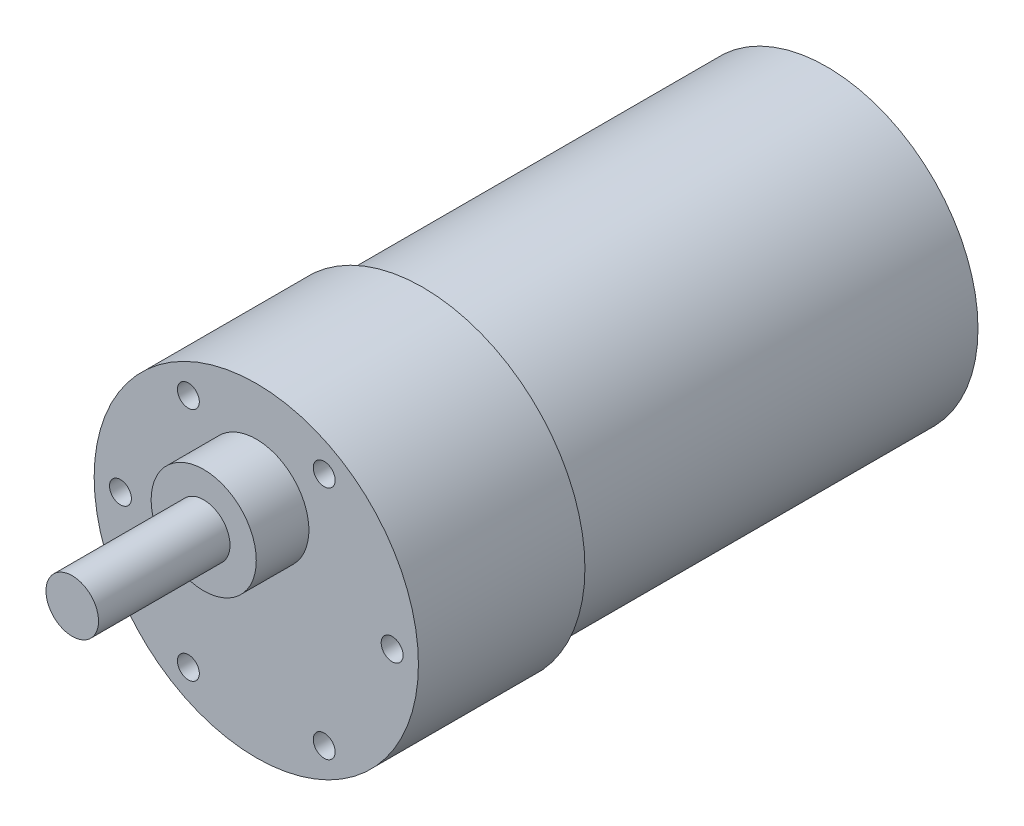
ISO-10303-21;
HEADER;
FILE_DESCRIPTION(('STEP AP214'),'2;1');
FILE_NAME('part.step','',(''),(''),'','','');
FILE_SCHEMA(('AUTOMOTIVE_DESIGN { 1 0 10303 214 1 1 1 1 }'));
ENDSEC;
DATA;
#1=APPLICATION_CONTEXT('core data for automotive mechanical design processes');
#2=APPLICATION_PROTOCOL_DEFINITION('international standard','automotive_design',2000,#1);
#3=PRODUCT_CONTEXT('',#1,'mechanical');
#4=PRODUCT('Part','Part','',(#3));
#5=PRODUCT_RELATED_PRODUCT_CATEGORY('part','',(#4));
#6=PRODUCT_DEFINITION_FORMATION('','',#4);
#7=PRODUCT_DEFINITION_CONTEXT('part definition',#1,'design');
#8=PRODUCT_DEFINITION('design','',#6,#7);
#9=PRODUCT_DEFINITION_SHAPE('','',#8);
#10=(LENGTH_UNIT() NAMED_UNIT(*) SI_UNIT(.MILLI.,.METRE.));
#11=(NAMED_UNIT(*) PLANE_ANGLE_UNIT() SI_UNIT($,.RADIAN.));
#12=(NAMED_UNIT(*) SI_UNIT($,.STERADIAN.) SOLID_ANGLE_UNIT());
#13=UNCERTAINTY_MEASURE_WITH_UNIT(LENGTH_MEASURE(1.E-05),#10,'distance_accuracy_value','');
#14=(GEOMETRIC_REPRESENTATION_CONTEXT(3) GLOBAL_UNCERTAINTY_ASSIGNED_CONTEXT((#13)) GLOBAL_UNIT_ASSIGNED_CONTEXT((#10,
#11,#12)) REPRESENTATION_CONTEXT('',''));
#15=CARTESIAN_POINT('',(0.,0.,0.));
#16=DIRECTION('',(0.,0.,1.));
#17=DIRECTION('',(1.,0.,0.));
#18=AXIS2_PLACEMENT_3D('',#15,#16,#17);
#19=CARTESIAN_POINT('',(0.,0.,0.));
#20=DIRECTION('',(0.,0.,-1.));
#21=DIRECTION('',(-1.,0.,0.));
#22=AXIS2_PLACEMENT_3D('',#19,#20,#21);
#23=PLANE('',#22);
#24=CARTESIAN_POINT('',(-15.5,1.08235921504137E-13,0.));
#25=DIRECTION('',(0.,0.,1.));
#26=DIRECTION('',(1.,0.,0.));
#27=AXIS2_PLACEMENT_3D('',#24,#25,#26);
#28=CIRCLE('',#27,1.25);
#29=CARTESIAN_POINT('',(-14.25,1.08235921504137E-13,0.));
#30=VERTEX_POINT('',#29);
#31=EDGE_CURVE('E72',#30,#30,#28,.T.);
#32=ORIENTED_EDGE('',*,*,#31,.F.);
#33=EDGE_LOOP('',(#32));
#34=FACE_BOUND('',#33,.T.);
#35=CARTESIAN_POINT('',(-7.74999999999987,13.4233937586589,0.));
#36=DIRECTION('',(0.,0.,1.));
#37=DIRECTION('',(1.,0.,0.));
#38=AXIS2_PLACEMENT_3D('',#35,#36,#37);
#39=CIRCLE('',#38,1.25);
#40=CARTESIAN_POINT('',(-6.49999999999988,13.4233937586589,0.));
#41=VERTEX_POINT('',#40);
#42=EDGE_CURVE('E71',#41,#41,#39,.T.);
#43=ORIENTED_EDGE('',*,*,#42,.F.);
#44=EDGE_LOOP('',(#43));
#45=FACE_BOUND('',#44,.T.);
#46=CARTESIAN_POINT('',(7.75000000000016,13.4233937586587,0.));
#47=DIRECTION('',(0.,0.,1.));
#48=DIRECTION('',(1.,0.,0.));
#49=AXIS2_PLACEMENT_3D('',#46,#47,#48);
#50=CIRCLE('',#49,1.25);
#51=CARTESIAN_POINT('',(9.00000000000016,13.4233937586587,0.));
#52=VERTEX_POINT('',#51);
#53=EDGE_CURVE('E82',#52,#52,#50,.T.);
#54=ORIENTED_EDGE('',*,*,#53,.F.);
#55=EDGE_LOOP('',(#54));
#56=FACE_BOUND('',#55,.T.);
#57=CARTESIAN_POINT('',(15.5,0.,0.));
#58=DIRECTION('',(0.,0.,1.));
#59=DIRECTION('',(1.,0.,0.));
#60=AXIS2_PLACEMENT_3D('',#57,#58,#59);
#61=CIRCLE('',#60,1.25);
#62=CARTESIAN_POINT('',(16.75,0.,0.));
#63=VERTEX_POINT('',#62);
#64=EDGE_CURVE('E88',#63,#63,#61,.T.);
#65=ORIENTED_EDGE('',*,*,#64,.F.);
#66=EDGE_LOOP('',(#65));
#67=FACE_BOUND('',#66,.T.);
#68=CARTESIAN_POINT('',(7.74999999999997,-13.4233937586588,0.));
#69=DIRECTION('',(0.,0.,1.));
#70=DIRECTION('',(1.,0.,0.));
#71=AXIS2_PLACEMENT_3D('',#68,#69,#70);
#72=CIRCLE('',#71,1.25);
#73=CARTESIAN_POINT('',(8.99999999999997,-13.4233937586588,0.));
#74=VERTEX_POINT('',#73);
#75=EDGE_CURVE('E94',#74,#74,#72,.T.);
#76=ORIENTED_EDGE('',*,*,#75,.F.);
#77=EDGE_LOOP('',(#76));
#78=FACE_BOUND('',#77,.T.);
#79=CARTESIAN_POINT('',(-7.75000000000006,-13.4233937586588,0.));
#80=DIRECTION('',(0.,0.,1.));
#81=DIRECTION('',(1.,0.,0.));
#82=AXIS2_PLACEMENT_3D('',#79,#80,#81);
#83=CIRCLE('',#82,1.25);
#84=CARTESIAN_POINT('',(-6.50000000000006,-13.4233937586588,0.));
#85=VERTEX_POINT('',#84);
#86=EDGE_CURVE('E100',#85,#85,#83,.T.);
#87=ORIENTED_EDGE('',*,*,#86,.F.);
#88=EDGE_LOOP('',(#87));
#89=FACE_BOUND('',#88,.T.);
#90=CARTESIAN_POINT('',(0.,7.,0.));
#91=DIRECTION('',(0.,0.,-1.));
#92=DIRECTION('',(-1.,0.,0.));
#93=AXIS2_PLACEMENT_3D('',#90,#91,#92);
#94=CIRCLE('',#93,6.);
#95=CARTESIAN_POINT('',(-6.,7.,0.));
#96=VERTEX_POINT('',#95);
#97=EDGE_CURVE('E11',#96,#96,#94,.F.);
#98=ORIENTED_EDGE('',*,*,#97,.F.);
#99=EDGE_LOOP('',(#98));
#100=FACE_BOUND('',#99,.T.);
#101=CARTESIAN_POINT('',(0.,0.,0.));
#102=DIRECTION('',(0.,0.,1.));
#103=DIRECTION('',(1.,0.,0.));
#104=AXIS2_PLACEMENT_3D('',#101,#102,#103);
#105=CIRCLE('',#104,18.5);
#106=CARTESIAN_POINT('',(18.5,0.,0.));
#107=VERTEX_POINT('',#106);
#108=EDGE_CURVE('E42',#107,#107,#105,.T.);
#109=ORIENTED_EDGE('',*,*,#108,.T.);
#110=EDGE_LOOP('',(#109));
#111=FACE_BOUND('',#110,.T.);
#112=ADVANCED_FACE('F34',(#34,#45,#56,#67,#78,#89,#100,#111),#23,.F.);
#113=CARTESIAN_POINT('',(0.,0.,4.91840427773817));
#114=DIRECTION('',(0.,0.,1.));
#115=DIRECTION('',(1.,0.,0.));
#116=AXIS2_PLACEMENT_3D('',#113,#114,#115);
#117=CYLINDRICAL_SURFACE('',#116,18.5);
#118=ORIENTED_EDGE('',*,*,#108,.F.);
#119=EDGE_LOOP('',(#118));
#120=FACE_BOUND('',#119,.T.);
#121=CARTESIAN_POINT('',(0.,0.,-19.));
#122=DIRECTION('',(0.,0.,1.));
#123=DIRECTION('',(1.,0.,0.));
#124=AXIS2_PLACEMENT_3D('',#121,#122,#123);
#125=CIRCLE('',#124,18.5);
#126=CARTESIAN_POINT('',(18.5,0.,-19.));
#127=VERTEX_POINT('',#126);
#128=EDGE_CURVE('E118',#127,#127,#125,.T.);
#129=ORIENTED_EDGE('',*,*,#128,.T.);
#130=EDGE_LOOP('',(#129));
#131=FACE_BOUND('',#130,.T.);
#132=ADVANCED_FACE('F125',(#120,#131),#117,.T.);
#133=CARTESIAN_POINT('',(0.,18.5,-19.));
#134=DIRECTION('',(0.,0.,1.));
#135=DIRECTION('',(1.,0.,0.));
#136=AXIS2_PLACEMENT_3D('',#133,#134,#135);
#137=PLANE('',#136);
#138=ORIENTED_EDGE('',*,*,#128,.F.);
#139=EDGE_LOOP('',(#138));
#140=FACE_BOUND('',#139,.T.);
#141=CARTESIAN_POINT('',(0.,0.,-19.));
#142=DIRECTION('',(0.,0.,1.));
#143=DIRECTION('',(1.,0.,0.));
#144=AXIS2_PLACEMENT_3D('',#141,#142,#143);
#145=CIRCLE('',#144,17.25);
#146=CARTESIAN_POINT('',(17.25,0.,-19.));
#147=VERTEX_POINT('',#146);
#148=EDGE_CURVE('E115',#147,#147,#145,.T.);
#149=ORIENTED_EDGE('',*,*,#148,.T.);
#150=EDGE_LOOP('',(#149));
#151=FACE_BOUND('',#150,.T.);
#152=ADVANCED_FACE('F128',(#140,#151),#137,.F.);
#153=CARTESIAN_POINT('',(0.,0.,4.91840427773817));
#154=DIRECTION('',(0.,0.,1.));
#155=DIRECTION('',(1.,0.,0.));
#156=AXIS2_PLACEMENT_3D('',#153,#154,#155);
#157=CYLINDRICAL_SURFACE('',#156,17.25);
#158=ORIENTED_EDGE('',*,*,#148,.F.);
#159=EDGE_LOOP('',(#158));
#160=FACE_BOUND('',#159,.T.);
#161=CARTESIAN_POINT('',(0.,0.,-65.1));
#162=DIRECTION('',(0.,0.,1.));
#163=DIRECTION('',(1.,0.,0.));
#164=AXIS2_PLACEMENT_3D('',#161,#162,#163);
#165=CIRCLE('',#164,17.25);
#166=CARTESIAN_POINT('',(17.25,0.,-65.1));
#167=VERTEX_POINT('',#166);
#168=EDGE_CURVE('E112',#167,#167,#165,.T.);
#169=ORIENTED_EDGE('',*,*,#168,.T.);
#170=EDGE_LOOP('',(#169));
#171=FACE_BOUND('',#170,.T.);
#172=ADVANCED_FACE('F133',(#160,#171),#157,.T.);
#173=CARTESIAN_POINT('',(0.,17.25,-65.1));
#174=DIRECTION('',(0.,0.,1.));
#175=DIRECTION('',(1.,0.,0.));
#176=AXIS2_PLACEMENT_3D('',#173,#174,#175);
#177=PLANE('',#176);
#178=ORIENTED_EDGE('',*,*,#168,.F.);
#179=EDGE_LOOP('',(#178));
#180=FACE_BOUND('',#179,.T.);
#181=ADVANCED_FACE('F139',(#180),#177,.F.);
#182=CARTESIAN_POINT('',(0.,7.,6.));
#183=DIRECTION('',(0.,0.,-1.));
#184=DIRECTION('',(-1.,0.,0.));
#185=AXIS2_PLACEMENT_3D('',#182,#183,#184);
#186=CYLINDRICAL_SURFACE('',#185,6.);
#187=CARTESIAN_POINT('',(0.,7.,6.));
#188=DIRECTION('',(0.,0.,1.));
#189=DIRECTION('',(1.,0.,0.));
#190=AXIS2_PLACEMENT_3D('',#187,#188,#189);
#191=CIRCLE('',#190,6.);
#192=CARTESIAN_POINT('',(6.,7.,6.));
#193=VERTEX_POINT('',#192);
#194=EDGE_CURVE('E109',#193,#193,#191,.T.);
#195=ORIENTED_EDGE('',*,*,#194,.F.);
#196=EDGE_LOOP('',(#195));
#197=FACE_BOUND('',#196,.T.);
#198=ORIENTED_EDGE('',*,*,#97,.T.);
#199=EDGE_LOOP('',(#198));
#200=FACE_BOUND('',#199,.T.);
#201=ADVANCED_FACE('F144',(#197,#200),#186,.T.);
#202=CARTESIAN_POINT('',(0.,7.,6.));
#203=DIRECTION('',(0.,0.,1.));
#204=DIRECTION('',(1.,0.,0.));
#205=AXIS2_PLACEMENT_3D('',#202,#203,#204);
#206=PLANE('',#205);
#207=CARTESIAN_POINT('',(0.,7.,6.));
#208=DIRECTION('',(0.,0.,1.));
#209=DIRECTION('',(1.,0.,0.));
#210=AXIS2_PLACEMENT_3D('',#207,#208,#209);
#211=CIRCLE('',#210,3.);
#212=CARTESIAN_POINT('',(3.,7.,6.));
#213=VERTEX_POINT('',#212);
#214=EDGE_CURVE('E37',#213,#213,#211,.F.);
#215=ORIENTED_EDGE('',*,*,#214,.T.);
#216=EDGE_LOOP('',(#215));
#217=FACE_BOUND('',#216,.T.);
#218=ORIENTED_EDGE('',*,*,#194,.T.);
#219=EDGE_LOOP('',(#218));
#220=FACE_BOUND('',#219,.T.);
#221=ADVANCED_FACE('F149',(#217,#220),#206,.T.);
#222=CARTESIAN_POINT('',(0.,7.,21.));
#223=DIRECTION('',(0.,0.,-1.));
#224=DIRECTION('',(-1.,0.,0.));
#225=AXIS2_PLACEMENT_3D('',#222,#223,#224);
#226=CYLINDRICAL_SURFACE('',#225,3.);
#227=ORIENTED_EDGE('',*,*,#214,.F.);
#228=EDGE_LOOP('',(#227));
#229=FACE_BOUND('',#228,.T.);
#230=CARTESIAN_POINT('',(0.,7.,21.));
#231=DIRECTION('',(0.,0.,1.));
#232=DIRECTION('',(1.,0.,0.));
#233=AXIS2_PLACEMENT_3D('',#230,#231,#232);
#234=CIRCLE('',#233,3.);
#235=CARTESIAN_POINT('',(3.,7.,21.));
#236=VERTEX_POINT('',#235);
#237=EDGE_CURVE('E106',#236,#236,#234,.T.);
#238=ORIENTED_EDGE('',*,*,#237,.F.);
#239=EDGE_LOOP('',(#238));
#240=FACE_BOUND('',#239,.T.);
#241=ADVANCED_FACE('F190',(#229,#240),#226,.T.);
#242=CARTESIAN_POINT('',(0.,7.,21.));
#243=DIRECTION('',(0.,0.,1.));
#244=DIRECTION('',(1.,0.,0.));
#245=AXIS2_PLACEMENT_3D('',#242,#243,#244);
#246=PLANE('',#245);
#247=ORIENTED_EDGE('',*,*,#237,.T.);
#248=EDGE_LOOP('',(#247));
#249=FACE_BOUND('',#248,.T.);
#250=ADVANCED_FACE('F183',(#249),#246,.T.);
#251=CARTESIAN_POINT('',(-7.75000000000006,-13.4233937586588,-10.));
#252=DIRECTION('',(0.,0.,1.));
#253=DIRECTION('',(1.,0.,0.));
#254=AXIS2_PLACEMENT_3D('',#251,#252,#253);
#255=CONICAL_SURFACE('',#254,1.25,1.02974425867665);
#256=CARTESIAN_POINT('',(-7.75000000000007,-13.4233937586588,-10.7510757737845));
#257=VERTEX_POINT('',#256);
#258=VERTEX_LOOP('',#257);
#259=FACE_BOUND('',#258,.T.);
#260=CARTESIAN_POINT('',(-7.75000000000006,-13.4233937586588,-10.));
#261=DIRECTION('',(0.,0.,1.));
#262=DIRECTION('',(1.,0.,0.));
#263=AXIS2_PLACEMENT_3D('',#260,#261,#262);
#264=CIRCLE('',#263,1.25);
#265=CARTESIAN_POINT('',(-6.50000000000007,-13.4233937586588,-10.));
#266=VERTEX_POINT('',#265);
#267=EDGE_CURVE('E103',#266,#266,#264,.T.);
#268=ORIENTED_EDGE('',*,*,#267,.T.);
#269=EDGE_LOOP('',(#268));
#270=FACE_BOUND('',#269,.T.);
#271=ADVANCED_FACE('F174',(#259,#270),#255,.F.);
#272=CARTESIAN_POINT('',(-7.75000000000006,-13.4233937586588,0.));
#273=DIRECTION('',(0.,0.,1.));
#274=DIRECTION('',(1.,0.,0.));
#275=AXIS2_PLACEMENT_3D('',#272,#273,#274);
#276=CYLINDRICAL_SURFACE('',#275,1.25);
#277=ORIENTED_EDGE('',*,*,#267,.F.);
#278=EDGE_LOOP('',(#277));
#279=FACE_BOUND('',#278,.T.);
#280=ORIENTED_EDGE('',*,*,#86,.T.);
#281=EDGE_LOOP('',(#280));
#282=FACE_BOUND('',#281,.T.);
#283=ADVANCED_FACE('F171',(#279,#282),#276,.F.);
#284=CARTESIAN_POINT('',(7.74999999999997,-13.4233937586588,-10.));
#285=DIRECTION('',(0.,0.,1.));
#286=DIRECTION('',(1.,0.,0.));
#287=AXIS2_PLACEMENT_3D('',#284,#285,#286);
#288=CONICAL_SURFACE('',#287,1.25,1.02974425867665);
#289=CARTESIAN_POINT('',(7.74999999999997,-13.4233937586588,-10.7510757737845));
#290=VERTEX_POINT('',#289);
#291=VERTEX_LOOP('',#290);
#292=FACE_BOUND('',#291,.T.);
#293=CARTESIAN_POINT('',(7.74999999999997,-13.4233937586588,-10.));
#294=DIRECTION('',(0.,0.,1.));
#295=DIRECTION('',(1.,0.,0.));
#296=AXIS2_PLACEMENT_3D('',#293,#294,#295);
#297=CIRCLE('',#296,1.25);
#298=CARTESIAN_POINT('',(8.99999999999997,-13.4233937586588,-10.));
#299=VERTEX_POINT('',#298);
#300=EDGE_CURVE('E97',#299,#299,#297,.T.);
#301=ORIENTED_EDGE('',*,*,#300,.T.);
#302=EDGE_LOOP('',(#301));
#303=FACE_BOUND('',#302,.T.);
#304=ADVANCED_FACE('F173',(#292,#303),#288,.F.);
#305=CARTESIAN_POINT('',(7.74999999999997,-13.4233937586588,0.));
#306=DIRECTION('',(0.,0.,1.));
#307=DIRECTION('',(1.,0.,0.));
#308=AXIS2_PLACEMENT_3D('',#305,#306,#307);
#309=CYLINDRICAL_SURFACE('',#308,1.25);
#310=ORIENTED_EDGE('',*,*,#300,.F.);
#311=EDGE_LOOP('',(#310));
#312=FACE_BOUND('',#311,.T.);
#313=ORIENTED_EDGE('',*,*,#75,.T.);
#314=EDGE_LOOP('',(#313));
#315=FACE_BOUND('',#314,.T.);
#316=ADVANCED_FACE('F181',(#312,#315),#309,.F.);
#317=CARTESIAN_POINT('',(15.5,0.,-10.));
#318=DIRECTION('',(0.,0.,1.));
#319=DIRECTION('',(1.,0.,0.));
#320=AXIS2_PLACEMENT_3D('',#317,#318,#319);
#321=CONICAL_SURFACE('',#320,1.25,1.02974425867665);
#322=CARTESIAN_POINT('',(15.5,0.,-10.7510757737845));
#323=VERTEX_POINT('',#322);
#324=VERTEX_LOOP('',#323);
#325=FACE_BOUND('',#324,.T.);
#326=CARTESIAN_POINT('',(15.5,0.,-10.));
#327=DIRECTION('',(0.,0.,1.));
#328=DIRECTION('',(1.,0.,0.));
#329=AXIS2_PLACEMENT_3D('',#326,#327,#328);
#330=CIRCLE('',#329,1.25);
#331=CARTESIAN_POINT('',(16.75,0.,-10.));
#332=VERTEX_POINT('',#331);
#333=EDGE_CURVE('E91',#332,#332,#330,.T.);
#334=ORIENTED_EDGE('',*,*,#333,.T.);
#335=EDGE_LOOP('',(#334));
#336=FACE_BOUND('',#335,.T.);
#337=ADVANCED_FACE('F241',(#325,#336),#321,.F.);
#338=CARTESIAN_POINT('',(15.5,0.,0.));
#339=DIRECTION('',(0.,0.,1.));
#340=DIRECTION('',(1.,0.,0.));
#341=AXIS2_PLACEMENT_3D('',#338,#339,#340);
#342=CYLINDRICAL_SURFACE('',#341,1.25);
#343=ORIENTED_EDGE('',*,*,#333,.F.);
#344=EDGE_LOOP('',(#343));
#345=FACE_BOUND('',#344,.T.);
#346=ORIENTED_EDGE('',*,*,#64,.T.);
#347=EDGE_LOOP('',(#346));
#348=FACE_BOUND('',#347,.T.);
#349=ADVANCED_FACE('F250',(#345,#348),#342,.F.);
#350=CARTESIAN_POINT('',(7.75000000000016,13.4233937586587,-10.));
#351=DIRECTION('',(0.,0.,1.));
#352=DIRECTION('',(1.,0.,0.));
#353=AXIS2_PLACEMENT_3D('',#350,#351,#352);
#354=CONICAL_SURFACE('',#353,1.25,1.02974425867665);
#355=CARTESIAN_POINT('',(7.75000000000015,13.4233937586587,-10.7510757737845));
#356=VERTEX_POINT('',#355);
#357=VERTEX_LOOP('',#356);
#358=FACE_BOUND('',#357,.T.);
#359=CARTESIAN_POINT('',(7.75000000000016,13.4233937586587,-10.));
#360=DIRECTION('',(0.,0.,1.));
#361=DIRECTION('',(1.,0.,0.));
#362=AXIS2_PLACEMENT_3D('',#359,#360,#361);
#363=CIRCLE('',#362,1.25);
#364=CARTESIAN_POINT('',(9.00000000000015,13.4233937586587,-10.));
#365=VERTEX_POINT('',#364);
#366=EDGE_CURVE('E85',#365,#365,#363,.T.);
#367=ORIENTED_EDGE('',*,*,#366,.T.);
#368=EDGE_LOOP('',(#367));
#369=FACE_BOUND('',#368,.T.);
#370=ADVANCED_FACE('F260',(#358,#369),#354,.F.);
#371=CARTESIAN_POINT('',(7.75000000000016,13.4233937586587,0.));
#372=DIRECTION('',(0.,0.,1.));
#373=DIRECTION('',(1.,0.,0.));
#374=AXIS2_PLACEMENT_3D('',#371,#372,#373);
#375=CYLINDRICAL_SURFACE('',#374,1.25);
#376=ORIENTED_EDGE('',*,*,#366,.F.);
#377=EDGE_LOOP('',(#376));
#378=FACE_BOUND('',#377,.T.);
#379=ORIENTED_EDGE('',*,*,#53,.T.);
#380=EDGE_LOOP('',(#379));
#381=FACE_BOUND('',#380,.T.);
#382=ADVANCED_FACE('F270',(#378,#381),#375,.F.);
#383=CARTESIAN_POINT('',(-7.74999999999987,13.4233937586589,-10.));
#384=DIRECTION('',(0.,0.,1.));
#385=DIRECTION('',(1.,0.,0.));
#386=AXIS2_PLACEMENT_3D('',#383,#384,#385);
#387=CONICAL_SURFACE('',#386,1.25,1.02974425867665);
#388=CARTESIAN_POINT('',(-7.74999999999988,13.4233937586589,-10.7510757737845));
#389=VERTEX_POINT('',#388);
#390=VERTEX_LOOP('',#389);
#391=FACE_BOUND('',#390,.T.);
#392=CARTESIAN_POINT('',(-7.74999999999987,13.4233937586589,-10.));
#393=DIRECTION('',(0.,0.,1.));
#394=DIRECTION('',(1.,0.,0.));
#395=AXIS2_PLACEMENT_3D('',#392,#393,#394);
#396=CIRCLE('',#395,1.25);
#397=CARTESIAN_POINT('',(-6.49999999999988,13.4233937586589,-10.));
#398=VERTEX_POINT('',#397);
#399=EDGE_CURVE('E75',#398,#398,#396,.T.);
#400=ORIENTED_EDGE('',*,*,#399,.T.);
#401=EDGE_LOOP('',(#400));
#402=FACE_BOUND('',#401,.T.);
#403=ADVANCED_FACE('F280',(#391,#402),#387,.F.);
#404=CARTESIAN_POINT('',(-7.74999999999987,13.4233937586589,0.));
#405=DIRECTION('',(0.,0.,1.));
#406=DIRECTION('',(1.,0.,0.));
#407=AXIS2_PLACEMENT_3D('',#404,#405,#406);
#408=CYLINDRICAL_SURFACE('',#407,1.25);
#409=ORIENTED_EDGE('',*,*,#399,.F.);
#410=EDGE_LOOP('',(#409));
#411=FACE_BOUND('',#410,.T.);
#412=ORIENTED_EDGE('',*,*,#42,.T.);
#413=EDGE_LOOP('',(#412));
#414=FACE_BOUND('',#413,.T.);
#415=ADVANCED_FACE('F65',(#411,#414),#408,.F.);
#416=CARTESIAN_POINT('',(-15.5,1.08235921504137E-13,-10.));
#417=DIRECTION('',(0.,0.,1.));
#418=DIRECTION('',(1.,0.,0.));
#419=AXIS2_PLACEMENT_3D('',#416,#417,#418);
#420=CONICAL_SURFACE('',#419,1.25,1.02974425867665);
#421=CARTESIAN_POINT('',(-15.5,1.08235921504137E-13,-10.7510757737845));
#422=VERTEX_POINT('',#421);
#423=VERTEX_LOOP('',#422);
#424=FACE_BOUND('',#423,.T.);
#425=CARTESIAN_POINT('',(-15.5,1.08235921504137E-13,-10.));
#426=DIRECTION('',(0.,0.,1.));
#427=DIRECTION('',(1.,0.,0.));
#428=AXIS2_PLACEMENT_3D('',#425,#426,#427);
#429=CIRCLE('',#428,1.25);
#430=CARTESIAN_POINT('',(-14.25,1.08235921504137E-13,-10.));
#431=VERTEX_POINT('',#430);
#432=EDGE_CURVE('E69',#431,#431,#429,.T.);
#433=ORIENTED_EDGE('',*,*,#432,.T.);
#434=EDGE_LOOP('',(#433));
#435=FACE_BOUND('',#434,.T.);
#436=ADVANCED_FACE('F61',(#424,#435),#420,.F.);
#437=CARTESIAN_POINT('',(-15.5,1.08235921504137E-13,0.));
#438=DIRECTION('',(0.,0.,1.));
#439=DIRECTION('',(1.,0.,0.));
#440=AXIS2_PLACEMENT_3D('',#437,#438,#439);
#441=CYLINDRICAL_SURFACE('',#440,1.25);
#442=ORIENTED_EDGE('',*,*,#432,.F.);
#443=EDGE_LOOP('',(#442));
#444=FACE_BOUND('',#443,.T.);
#445=ORIENTED_EDGE('',*,*,#31,.T.);
#446=EDGE_LOOP('',(#445));
#447=FACE_BOUND('',#446,.T.);
#448=ADVANCED_FACE('F64',(#444,#447),#441,.F.);
#449=CLOSED_SHELL('',(#112,#132,#152,#172,#181,#201,#221,#241,#250,#271,#283,#304,#316,#337,
#349,#370,#382,#403,#415,#436,#448));
#450=MANIFOLD_SOLID_BREP('B2',#449);
#451=ADVANCED_BREP_SHAPE_REPRESENTATION('',(#18,#450),#14);
#452=SHAPE_DEFINITION_REPRESENTATION(#9,#451);
ENDSEC;
END-ISO-10303-21;
